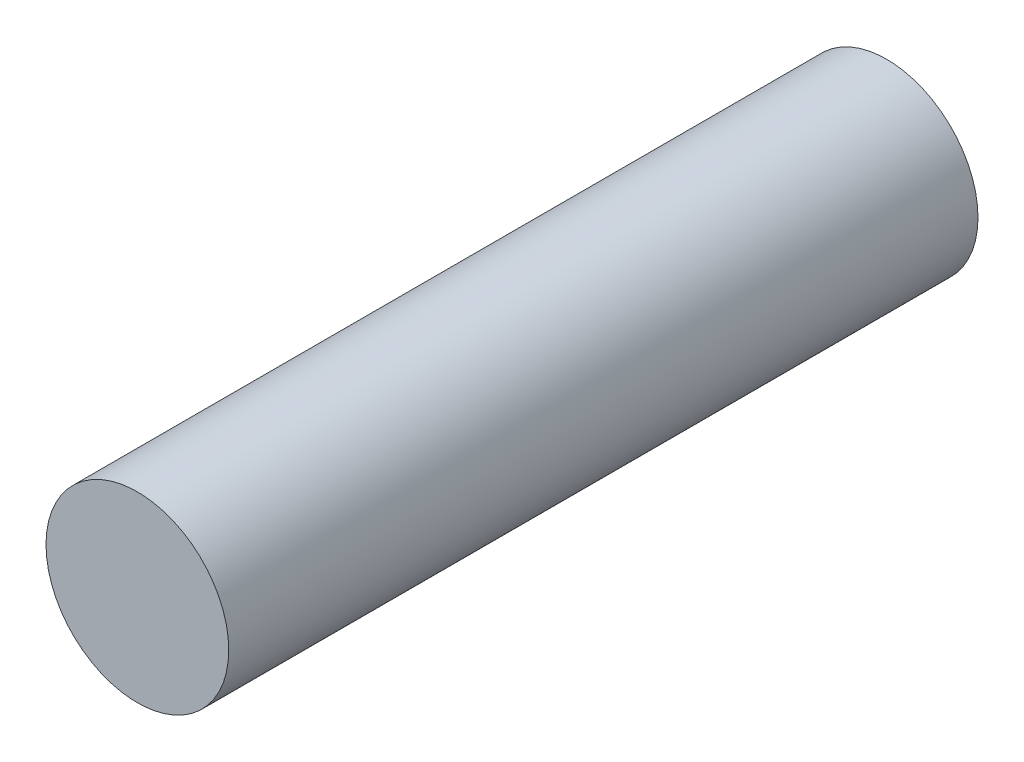
ISO-10303-21;
HEADER;
FILE_DESCRIPTION(('STEP AP214'),'2;1');
FILE_NAME('part.step','',(''),(''),'','','');
FILE_SCHEMA(('AUTOMOTIVE_DESIGN { 1 0 10303 214 1 1 1 1 }'));
ENDSEC;
DATA;
#1=APPLICATION_CONTEXT('core data for automotive mechanical design processes');
#2=APPLICATION_PROTOCOL_DEFINITION('international standard','automotive_design',2000,#1);
#3=PRODUCT_CONTEXT('',#1,'mechanical');
#4=PRODUCT('Part','Part','',(#3));
#5=PRODUCT_RELATED_PRODUCT_CATEGORY('part','',(#4));
#6=PRODUCT_DEFINITION_FORMATION('','',#4);
#7=PRODUCT_DEFINITION_CONTEXT('part definition',#1,'design');
#8=PRODUCT_DEFINITION('design','',#6,#7);
#9=PRODUCT_DEFINITION_SHAPE('','',#8);
#10=(LENGTH_UNIT() NAMED_UNIT(*) SI_UNIT(.MILLI.,.METRE.));
#11=(NAMED_UNIT(*) PLANE_ANGLE_UNIT() SI_UNIT($,.RADIAN.));
#12=(NAMED_UNIT(*) SI_UNIT($,.STERADIAN.) SOLID_ANGLE_UNIT());
#13=UNCERTAINTY_MEASURE_WITH_UNIT(LENGTH_MEASURE(1.E-05),#10,'distance_accuracy_value','');
#14=(GEOMETRIC_REPRESENTATION_CONTEXT(3) GLOBAL_UNCERTAINTY_ASSIGNED_CONTEXT((#13)) GLOBAL_UNIT_ASSIGNED_CONTEXT((#10,
#11,#12)) REPRESENTATION_CONTEXT('',''));
#15=CARTESIAN_POINT('',(0.,0.,0.));
#16=DIRECTION('',(0.,0.,1.));
#17=DIRECTION('',(1.,0.,0.));
#18=AXIS2_PLACEMENT_3D('',#15,#16,#17);
#19=CARTESIAN_POINT('',(0.,0.,20.5));
#20=DIRECTION('',(0.,0.,1.));
#21=DIRECTION('',(1.,0.,0.));
#22=AXIS2_PLACEMENT_3D('',#19,#20,#21);
#23=PLANE('',#22);
#24=CARTESIAN_POINT('',(0.,0.,20.5));
#25=DIRECTION('',(0.,0.,1.));
#26=DIRECTION('',(1.,0.,0.));
#27=AXIS2_PLACEMENT_3D('',#24,#25,#26);
#28=CIRCLE('',#27,2.5);
#29=CARTESIAN_POINT('',(2.5,0.,20.5));
#30=VERTEX_POINT('',#29);
#31=EDGE_CURVE('E11',#30,#30,#28,.T.);
#32=ORIENTED_EDGE('',*,*,#31,.T.);
#33=EDGE_LOOP('',(#32));
#34=FACE_BOUND('',#33,.T.);
#35=ADVANCED_FACE('F33',(#34),#23,.T.);
#36=CARTESIAN_POINT('',(0.,0.,0.));
#37=DIRECTION('',(0.,0.,1.));
#38=DIRECTION('',(1.,0.,0.));
#39=AXIS2_PLACEMENT_3D('',#36,#37,#38);
#40=PLANE('',#39);
#41=CARTESIAN_POINT('',(0.,0.,0.));
#42=DIRECTION('',(0.,0.,1.));
#43=DIRECTION('',(1.,0.,0.));
#44=AXIS2_PLACEMENT_3D('',#41,#42,#43);
#45=CIRCLE('',#44,2.5);
#46=CARTESIAN_POINT('',(2.5,0.,0.));
#47=VERTEX_POINT('',#46);
#48=EDGE_CURVE('E41',#47,#47,#45,.T.);
#49=ORIENTED_EDGE('',*,*,#48,.F.);
#50=EDGE_LOOP('',(#49));
#51=FACE_BOUND('',#50,.T.);
#52=ADVANCED_FACE('F64',(#51),#40,.F.);
#53=CARTESIAN_POINT('',(0.,0.,0.));
#54=DIRECTION('',(0.,0.,1.));
#55=DIRECTION('',(1.,0.,0.));
#56=AXIS2_PLACEMENT_3D('',#53,#54,#55);
#57=CYLINDRICAL_SURFACE('',#56,2.5);
#58=ORIENTED_EDGE('',*,*,#31,.F.);
#59=EDGE_LOOP('',(#58));
#60=FACE_BOUND('',#59,.T.);
#61=ORIENTED_EDGE('',*,*,#48,.T.);
#62=EDGE_LOOP('',(#61));
#63=FACE_BOUND('',#62,.T.);
#64=ADVANCED_FACE('F72',(#60,#63),#57,.T.);
#65=CLOSED_SHELL('',(#35,#52,#64));
#66=MANIFOLD_SOLID_BREP('B2',#65);
#67=ADVANCED_BREP_SHAPE_REPRESENTATION('',(#18,#66),#14);
#68=SHAPE_DEFINITION_REPRESENTATION(#9,#67);
ENDSEC;
END-ISO-10303-21;
